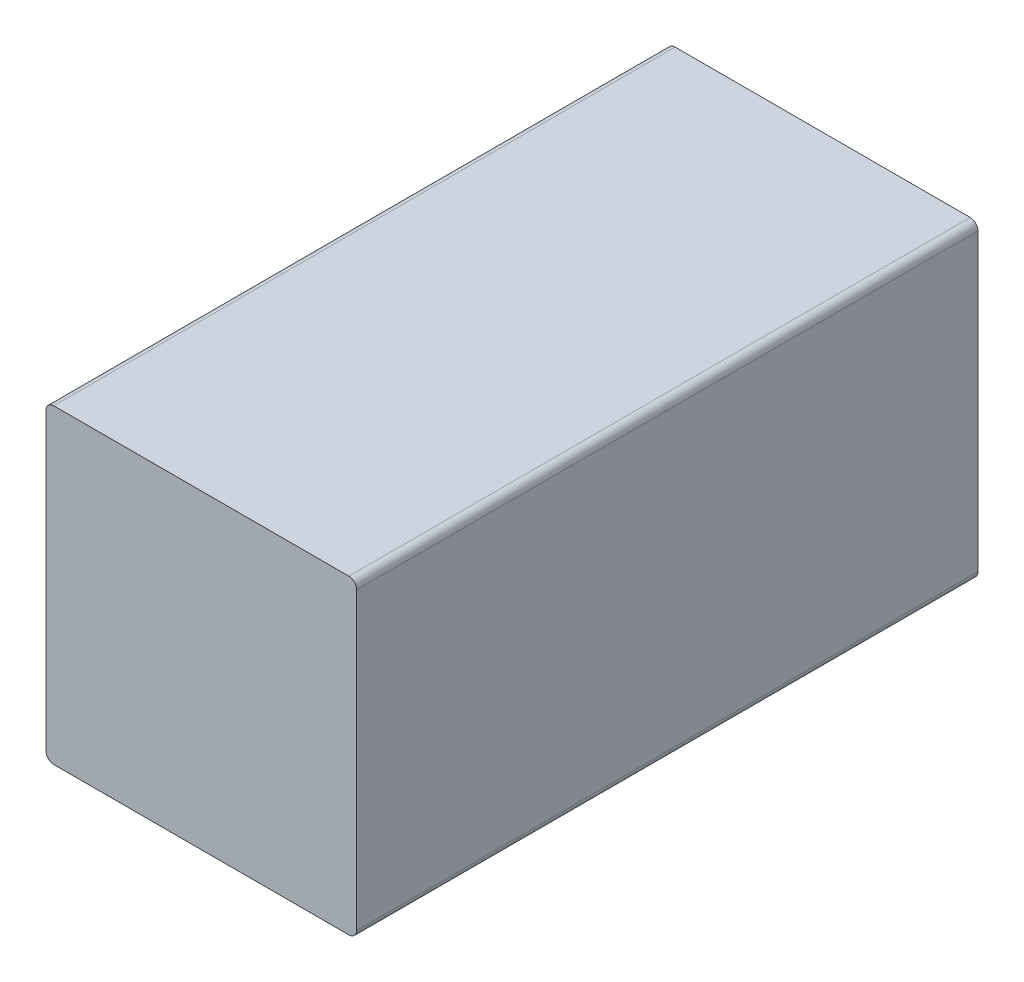
ISO-10303-21;
HEADER;
FILE_DESCRIPTION(('STEP AP214'),'2;1');
FILE_NAME('part.step','',(''),(''),'','','');
FILE_SCHEMA(('AUTOMOTIVE_DESIGN { 1 0 10303 214 1 1 1 1 }'));
ENDSEC;
DATA;
#1=APPLICATION_CONTEXT('core data for automotive mechanical design processes');
#2=APPLICATION_PROTOCOL_DEFINITION('international standard','automotive_design',2000,#1);
#3=PRODUCT_CONTEXT('',#1,'mechanical');
#4=PRODUCT('Part','Part','',(#3));
#5=PRODUCT_RELATED_PRODUCT_CATEGORY('part','',(#4));
#6=PRODUCT_DEFINITION_FORMATION('','',#4);
#7=PRODUCT_DEFINITION_CONTEXT('part definition',#1,'design');
#8=PRODUCT_DEFINITION('design','',#6,#7);
#9=PRODUCT_DEFINITION_SHAPE('','',#8);
#10=(LENGTH_UNIT() NAMED_UNIT(*) SI_UNIT(.MILLI.,.METRE.));
#11=(NAMED_UNIT(*) PLANE_ANGLE_UNIT() SI_UNIT($,.RADIAN.));
#12=(NAMED_UNIT(*) SI_UNIT($,.STERADIAN.) SOLID_ANGLE_UNIT());
#13=UNCERTAINTY_MEASURE_WITH_UNIT(LENGTH_MEASURE(1.E-05),#10,'distance_accuracy_value','');
#14=(GEOMETRIC_REPRESENTATION_CONTEXT(3) GLOBAL_UNCERTAINTY_ASSIGNED_CONTEXT((#13)) GLOBAL_UNIT_ASSIGNED_CONTEXT((#10,
#11,#12)) REPRESENTATION_CONTEXT('',''));
#15=CARTESIAN_POINT('',(0.,0.,0.));
#16=DIRECTION('',(0.,0.,1.));
#17=DIRECTION('',(1.,0.,0.));
#18=AXIS2_PLACEMENT_3D('',#15,#16,#17);
#19=CARTESIAN_POINT('',(-2.38125,2.38125000000004,4.7625));
#20=DIRECTION('',(1.,0.,0.));
#21=DIRECTION('',(0.,0.,-1.));
#22=AXIS2_PLACEMENT_3D('',#19,#20,#21);
#23=PLANE('',#22);
#24=DIRECTION('',(0.,-1.,0.));
#25=VECTOR('',#24,1.);
#26=CARTESIAN_POINT('',(-2.38125,2.38125000000004,-4.7625));
#27=LINE('',#26,#25);
#28=CARTESIAN_POINT('',(-2.38125,2.26218750000004,-4.7625));
#29=VERTEX_POINT('',#28);
#30=CARTESIAN_POINT('',(-2.38125,-2.26218750000004,-4.7625));
#31=VERTEX_POINT('',#30);
#32=EDGE_CURVE('E132',#29,#31,#27,.T.);
#33=ORIENTED_EDGE('',*,*,#32,.T.);
#34=DIRECTION('',(0.,0.,-1.));
#35=VECTOR('',#34,1.);
#36=CARTESIAN_POINT('',(-2.38125,-2.26218750000004,4.7625));
#37=LINE('',#36,#35);
#38=CARTESIAN_POINT('',(-2.38125,-2.26218750000004,4.7625));
#39=VERTEX_POINT('',#38);
#40=EDGE_CURVE('E155',#31,#39,#37,.F.);
#41=ORIENTED_EDGE('',*,*,#40,.T.);
#42=DIRECTION('',(0.,-1.,0.));
#43=VECTOR('',#42,1.);
#44=CARTESIAN_POINT('',(-2.38125,2.38125000000004,4.7625));
#45=LINE('',#44,#43);
#46=CARTESIAN_POINT('',(-2.38125,2.26218750000004,4.7625));
#47=VERTEX_POINT('',#46);
#48=EDGE_CURVE('E130',#47,#39,#45,.T.);
#49=ORIENTED_EDGE('',*,*,#48,.F.);
#50=DIRECTION('',(0.,0.,-1.));
#51=VECTOR('',#50,1.);
#52=CARTESIAN_POINT('',(-2.38125,2.26218750000004,4.7625));
#53=LINE('',#52,#51);
#54=EDGE_CURVE('E152',#47,#29,#53,.T.);
#55=ORIENTED_EDGE('',*,*,#54,.T.);
#56=EDGE_LOOP('',(#33,#41,#49,#55));
#57=FACE_BOUND('',#56,.T.);
#58=ADVANCED_FACE('F37',(#57),#23,.F.);
#59=CARTESIAN_POINT('',(-2.38125,-2.38125000000004,4.7625));
#60=DIRECTION('',(0.,1.,0.));
#61=DIRECTION('',(0.,0.,1.));
#62=AXIS2_PLACEMENT_3D('',#59,#60,#61);
#63=PLANE('',#62);
#64=DIRECTION('',(1.,0.,0.));
#65=VECTOR('',#64,1.);
#66=CARTESIAN_POINT('',(-2.38125,-2.38125000000004,-4.7625));
#67=LINE('',#66,#65);
#68=CARTESIAN_POINT('',(-2.2621875,-2.38125000000004,-4.7625));
#69=VERTEX_POINT('',#68);
#70=CARTESIAN_POINT('',(2.2621875,-2.38125000000004,-4.7625));
#71=VERTEX_POINT('',#70);
#72=EDGE_CURVE('E128',#69,#71,#67,.T.);
#73=ORIENTED_EDGE('',*,*,#72,.T.);
#74=DIRECTION('',(0.,0.,-1.));
#75=VECTOR('',#74,1.);
#76=CARTESIAN_POINT('',(2.2621875,-2.38125000000004,4.7625));
#77=LINE('',#76,#75);
#78=CARTESIAN_POINT('',(2.2621875,-2.38125000000004,4.7625));
#79=VERTEX_POINT('',#78);
#80=EDGE_CURVE('E107',#71,#79,#77,.F.);
#81=ORIENTED_EDGE('',*,*,#80,.T.);
#82=DIRECTION('',(1.,0.,0.));
#83=VECTOR('',#82,1.);
#84=CARTESIAN_POINT('',(-2.38125,-2.38125000000004,4.7625));
#85=LINE('',#84,#83);
#86=CARTESIAN_POINT('',(-2.2621875,-2.38125000000004,4.7625));
#87=VERTEX_POINT('',#86);
#88=EDGE_CURVE('E171',#87,#79,#85,.T.);
#89=ORIENTED_EDGE('',*,*,#88,.F.);
#90=DIRECTION('',(0.,0.,-1.));
#91=VECTOR('',#90,1.);
#92=CARTESIAN_POINT('',(-2.2621875,-2.38125000000004,4.7625));
#93=LINE('',#92,#91);
#94=EDGE_CURVE('E112',#87,#69,#93,.T.);
#95=ORIENTED_EDGE('',*,*,#94,.T.);
#96=EDGE_LOOP('',(#73,#81,#89,#95));
#97=FACE_BOUND('',#96,.T.);
#98=ADVANCED_FACE('F188',(#97),#63,.F.);
#99=CARTESIAN_POINT('',(2.38125,-2.38125000000004,4.7625));
#100=DIRECTION('',(-1.,0.,0.));
#101=DIRECTION('',(0.,0.,1.));
#102=AXIS2_PLACEMENT_3D('',#99,#100,#101);
#103=PLANE('',#102);
#104=DIRECTION('',(0.,1.,0.));
#105=VECTOR('',#104,1.);
#106=CARTESIAN_POINT('',(2.38125,-2.38125000000004,4.7625));
#107=LINE('',#106,#105);
#108=CARTESIAN_POINT('',(2.38125,-2.26218750000004,4.7625));
#109=VERTEX_POINT('',#108);
#110=CARTESIAN_POINT('',(2.38125,2.26218750000004,4.7625));
#111=VERTEX_POINT('',#110);
#112=EDGE_CURVE('E121',#109,#111,#107,.T.);
#113=ORIENTED_EDGE('',*,*,#112,.F.);
#114=DIRECTION('',(0.,0.,-1.));
#115=VECTOR('',#114,1.);
#116=CARTESIAN_POINT('',(2.38125,-2.26218750000004,4.7625));
#117=LINE('',#116,#115);
#118=CARTESIAN_POINT('',(2.38125,-2.26218750000004,-4.7625));
#119=VERTEX_POINT('',#118);
#120=EDGE_CURVE('E106',#109,#119,#117,.T.);
#121=ORIENTED_EDGE('',*,*,#120,.T.);
#122=DIRECTION('',(0.,1.,0.));
#123=VECTOR('',#122,1.);
#124=CARTESIAN_POINT('',(2.38125,-2.38125000000004,-4.7625));
#125=LINE('',#124,#123);
#126=CARTESIAN_POINT('',(2.38125,2.26218750000004,-4.7625));
#127=VERTEX_POINT('',#126);
#128=EDGE_CURVE('E119',#119,#127,#125,.T.);
#129=ORIENTED_EDGE('',*,*,#128,.T.);
#130=DIRECTION('',(0.,0.,-1.));
#131=VECTOR('',#130,1.);
#132=CARTESIAN_POINT('',(2.38125,2.26218750000004,4.7625));
#133=LINE('',#132,#131);
#134=EDGE_CURVE('E123',#127,#111,#133,.F.);
#135=ORIENTED_EDGE('',*,*,#134,.T.);
#136=EDGE_LOOP('',(#113,#121,#129,#135));
#137=FACE_BOUND('',#136,.T.);
#138=ADVANCED_FACE('F118',(#137),#103,.F.);
#139=CARTESIAN_POINT('',(2.38125,2.38125000000004,4.7625));
#140=DIRECTION('',(0.,-1.,0.));
#141=DIRECTION('',(0.,0.,-1.));
#142=AXIS2_PLACEMENT_3D('',#139,#140,#141);
#143=PLANE('',#142);
#144=DIRECTION('',(-1.,0.,0.));
#145=VECTOR('',#144,1.);
#146=CARTESIAN_POINT('',(2.38125,2.38125000000004,-4.7625));
#147=LINE('',#146,#145);
#148=CARTESIAN_POINT('',(2.2621875,2.38125000000004,-4.7625));
#149=VERTEX_POINT('',#148);
#150=CARTESIAN_POINT('',(-2.2621875,2.38125000000004,-4.7625));
#151=VERTEX_POINT('',#150);
#152=EDGE_CURVE('E127',#149,#151,#147,.T.);
#153=ORIENTED_EDGE('',*,*,#152,.T.);
#154=DIRECTION('',(0.,0.,-1.));
#155=VECTOR('',#154,1.);
#156=CARTESIAN_POINT('',(-2.2621875,2.38125000000004,4.7625));
#157=LINE('',#156,#155);
#158=CARTESIAN_POINT('',(-2.2621875,2.38125000000004,4.7625));
#159=VERTEX_POINT('',#158);
#160=EDGE_CURVE('E11',#151,#159,#157,.F.);
#161=ORIENTED_EDGE('',*,*,#160,.T.);
#162=DIRECTION('',(-1.,0.,0.));
#163=VECTOR('',#162,1.);
#164=CARTESIAN_POINT('',(2.38125,2.38125000000004,4.7625));
#165=LINE('',#164,#163);
#166=CARTESIAN_POINT('',(2.2621875,2.38125000000004,4.7625));
#167=VERTEX_POINT('',#166);
#168=EDGE_CURVE('E136',#167,#159,#165,.T.);
#169=ORIENTED_EDGE('',*,*,#168,.F.);
#170=DIRECTION('',(0.,0.,-1.));
#171=VECTOR('',#170,1.);
#172=CARTESIAN_POINT('',(2.2621875,2.38125000000004,4.7625));
#173=LINE('',#172,#171);
#174=EDGE_CURVE('E45',#167,#149,#173,.T.);
#175=ORIENTED_EDGE('',*,*,#174,.T.);
#176=EDGE_LOOP('',(#153,#161,#169,#175));
#177=FACE_BOUND('',#176,.T.);
#178=ADVANCED_FACE('F158',(#177),#143,.F.);
#179=CARTESIAN_POINT('',(0.,0.,4.7625));
#180=DIRECTION('',(0.,0.,1.));
#181=DIRECTION('',(1.,0.,0.));
#182=AXIS2_PLACEMENT_3D('',#179,#180,#181);
#183=PLANE('',#182);
#184=ORIENTED_EDGE('',*,*,#88,.T.);
#185=CARTESIAN_POINT('',(2.2621875,-2.26218750000004,4.7625));
#186=DIRECTION('',(0.,0.,1.));
#187=DIRECTION('',(1.,0.,0.));
#188=AXIS2_PLACEMENT_3D('',#185,#186,#187);
#189=CIRCLE('',#188,0.1190625);
#190=EDGE_CURVE('E150',#79,#109,#189,.T.);
#191=ORIENTED_EDGE('',*,*,#190,.T.);
#192=ORIENTED_EDGE('',*,*,#112,.T.);
#193=CARTESIAN_POINT('',(2.2621875,2.26218750000004,4.7625));
#194=DIRECTION('',(0.,0.,1.));
#195=DIRECTION('',(1.,0.,0.));
#196=AXIS2_PLACEMENT_3D('',#193,#194,#195);
#197=CIRCLE('',#196,0.1190625);
#198=EDGE_CURVE('E57',#111,#167,#197,.T.);
#199=ORIENTED_EDGE('',*,*,#198,.T.);
#200=ORIENTED_EDGE('',*,*,#168,.T.);
#201=CARTESIAN_POINT('',(-2.2621875,2.26218750000004,4.7625));
#202=DIRECTION('',(0.,0.,1.));
#203=DIRECTION('',(1.,0.,0.));
#204=AXIS2_PLACEMENT_3D('',#201,#202,#203);
#205=CIRCLE('',#204,0.1190625);
#206=EDGE_CURVE('E146',#159,#47,#205,.T.);
#207=ORIENTED_EDGE('',*,*,#206,.T.);
#208=ORIENTED_EDGE('',*,*,#48,.T.);
#209=CARTESIAN_POINT('',(-2.2621875,-2.26218750000004,4.7625));
#210=DIRECTION('',(0.,0.,1.));
#211=DIRECTION('',(1.,0.,0.));
#212=AXIS2_PLACEMENT_3D('',#209,#210,#211);
#213=CIRCLE('',#212,0.1190625);
#214=EDGE_CURVE('E148',#39,#87,#213,.T.);
#215=ORIENTED_EDGE('',*,*,#214,.T.);
#216=EDGE_LOOP('',(#184,#191,#192,#199,#200,#207,#208,#215));
#217=FACE_BOUND('',#216,.T.);
#218=ADVANCED_FACE('F177',(#217),#183,.T.);
#219=CARTESIAN_POINT('',(0.,0.,-4.7625));
#220=DIRECTION('',(0.,0.,1.));
#221=DIRECTION('',(1.,0.,0.));
#222=AXIS2_PLACEMENT_3D('',#219,#220,#221);
#223=PLANE('',#222);
#224=ORIENTED_EDGE('',*,*,#128,.F.);
#225=CARTESIAN_POINT('',(2.2621875,-2.26218750000004,-4.7625));
#226=DIRECTION('',(0.,0.,1.));
#227=DIRECTION('',(1.,0.,0.));
#228=AXIS2_PLACEMENT_3D('',#225,#226,#227);
#229=CIRCLE('',#228,0.1190625);
#230=EDGE_CURVE('E102',#119,#71,#229,.F.);
#231=ORIENTED_EDGE('',*,*,#230,.T.);
#232=ORIENTED_EDGE('',*,*,#72,.F.);
#233=CARTESIAN_POINT('',(-2.2621875,-2.26218750000004,-4.7625));
#234=DIRECTION('',(0.,0.,1.));
#235=DIRECTION('',(1.,0.,0.));
#236=AXIS2_PLACEMENT_3D('',#233,#234,#235);
#237=CIRCLE('',#236,0.1190625);
#238=EDGE_CURVE('E113',#69,#31,#237,.F.);
#239=ORIENTED_EDGE('',*,*,#238,.T.);
#240=ORIENTED_EDGE('',*,*,#32,.F.);
#241=CARTESIAN_POINT('',(-2.2621875,2.26218750000004,-4.7625));
#242=DIRECTION('',(0.,0.,1.));
#243=DIRECTION('',(1.,0.,0.));
#244=AXIS2_PLACEMENT_3D('',#241,#242,#243);
#245=CIRCLE('',#244,0.1190625);
#246=EDGE_CURVE('E139',#29,#151,#245,.F.);
#247=ORIENTED_EDGE('',*,*,#246,.T.);
#248=ORIENTED_EDGE('',*,*,#152,.F.);
#249=CARTESIAN_POINT('',(2.2621875,2.26218750000004,-4.7625));
#250=DIRECTION('',(0.,0.,1.));
#251=DIRECTION('',(1.,0.,0.));
#252=AXIS2_PLACEMENT_3D('',#249,#250,#251);
#253=CIRCLE('',#252,0.1190625);
#254=EDGE_CURVE('E122',#149,#127,#253,.F.);
#255=ORIENTED_EDGE('',*,*,#254,.T.);
#256=EDGE_LOOP('',(#224,#231,#232,#239,#240,#247,#248,#255));
#257=FACE_BOUND('',#256,.T.);
#258=ADVANCED_FACE('F125',(#257),#223,.F.);
#259=CARTESIAN_POINT('',(2.2621875,-2.26218750000004,4.7625));
#260=DIRECTION('',(0.,0.,-1.));
#261=DIRECTION('',(-1.,0.,0.));
#262=AXIS2_PLACEMENT_3D('',#259,#260,#261);
#263=CYLINDRICAL_SURFACE('',#262,0.1190625);
#264=ORIENTED_EDGE('',*,*,#190,.F.);
#265=ORIENTED_EDGE('',*,*,#80,.F.);
#266=ORIENTED_EDGE('',*,*,#230,.F.);
#267=ORIENTED_EDGE('',*,*,#120,.F.);
#268=EDGE_LOOP('',(#264,#265,#266,#267));
#269=FACE_BOUND('',#268,.T.);
#270=ADVANCED_FACE('F105',(#269),#263,.T.);
#271=CARTESIAN_POINT('',(-2.2621875,-2.26218750000004,4.7625));
#272=DIRECTION('',(0.,0.,-1.));
#273=DIRECTION('',(-1.,0.,0.));
#274=AXIS2_PLACEMENT_3D('',#271,#272,#273);
#275=CYLINDRICAL_SURFACE('',#274,0.1190625);
#276=ORIENTED_EDGE('',*,*,#214,.F.);
#277=ORIENTED_EDGE('',*,*,#40,.F.);
#278=ORIENTED_EDGE('',*,*,#238,.F.);
#279=ORIENTED_EDGE('',*,*,#94,.F.);
#280=EDGE_LOOP('',(#276,#277,#278,#279));
#281=FACE_BOUND('',#280,.T.);
#282=ADVANCED_FACE('F199',(#281),#275,.T.);
#283=CARTESIAN_POINT('',(-2.2621875,2.26218750000004,4.7625));
#284=DIRECTION('',(0.,0.,-1.));
#285=DIRECTION('',(-1.,0.,0.));
#286=AXIS2_PLACEMENT_3D('',#283,#284,#285);
#287=CYLINDRICAL_SURFACE('',#286,0.1190625);
#288=ORIENTED_EDGE('',*,*,#206,.F.);
#289=ORIENTED_EDGE('',*,*,#160,.F.);
#290=ORIENTED_EDGE('',*,*,#246,.F.);
#291=ORIENTED_EDGE('',*,*,#54,.F.);
#292=EDGE_LOOP('',(#288,#289,#290,#291));
#293=FACE_BOUND('',#292,.T.);
#294=ADVANCED_FACE('F165',(#293),#287,.T.);
#295=CARTESIAN_POINT('',(2.2621875,2.26218750000004,4.7625));
#296=DIRECTION('',(0.,0.,-1.));
#297=DIRECTION('',(-1.,0.,0.));
#298=AXIS2_PLACEMENT_3D('',#295,#296,#297);
#299=CYLINDRICAL_SURFACE('',#298,0.1190625);
#300=ORIENTED_EDGE('',*,*,#198,.F.);
#301=ORIENTED_EDGE('',*,*,#134,.F.);
#302=ORIENTED_EDGE('',*,*,#254,.F.);
#303=ORIENTED_EDGE('',*,*,#174,.F.);
#304=EDGE_LOOP('',(#300,#301,#302,#303));
#305=FACE_BOUND('',#304,.T.);
#306=ADVANCED_FACE('F39',(#305),#299,.T.);
#307=CLOSED_SHELL('',(#58,#98,#138,#178,#218,#258,#270,#282,#294,#306));
#308=MANIFOLD_SOLID_BREP('B2',#307);
#309=ADVANCED_BREP_SHAPE_REPRESENTATION('',(#18,#308),#14);
#310=SHAPE_DEFINITION_REPRESENTATION(#9,#309);
ENDSEC;
END-ISO-10303-21;
